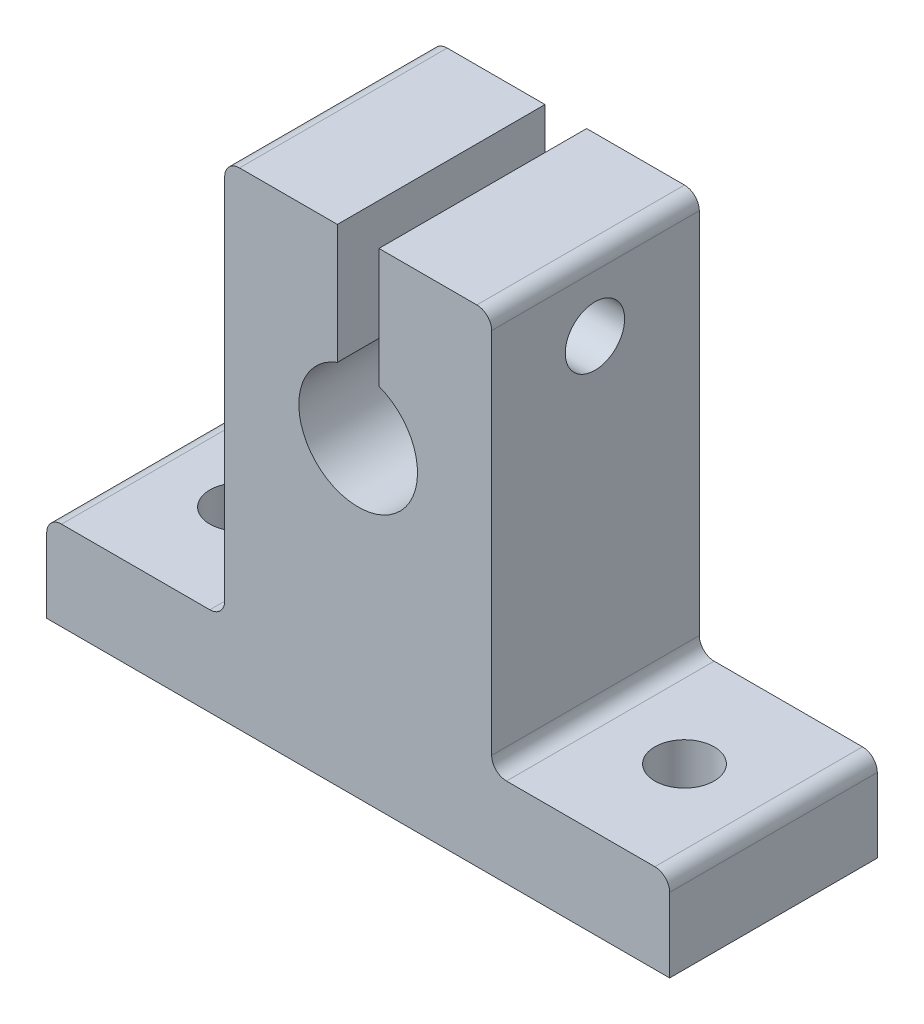
ISO-10303-21;
HEADER;
FILE_DESCRIPTION(('STEP AP214'),'2;1');
FILE_NAME('part.step','',(''),(''),'','','');
FILE_SCHEMA(('AUTOMOTIVE_DESIGN { 1 0 10303 214 1 1 1 1 }'));
ENDSEC;
DATA;
#1=APPLICATION_CONTEXT('core data for automotive mechanical design processes');
#2=APPLICATION_PROTOCOL_DEFINITION('international standard','automotive_design',2000,#1);
#3=PRODUCT_CONTEXT('',#1,'mechanical');
#4=PRODUCT('Part','Part','',(#3));
#5=PRODUCT_RELATED_PRODUCT_CATEGORY('part','',(#4));
#6=PRODUCT_DEFINITION_FORMATION('','',#4);
#7=PRODUCT_DEFINITION_CONTEXT('part definition',#1,'design');
#8=PRODUCT_DEFINITION('design','',#6,#7);
#9=PRODUCT_DEFINITION_SHAPE('','',#8);
#10=(LENGTH_UNIT() NAMED_UNIT(*) SI_UNIT(.MILLI.,.METRE.));
#11=(NAMED_UNIT(*) PLANE_ANGLE_UNIT() SI_UNIT($,.RADIAN.));
#12=(NAMED_UNIT(*) SI_UNIT($,.STERADIAN.) SOLID_ANGLE_UNIT());
#13=UNCERTAINTY_MEASURE_WITH_UNIT(LENGTH_MEASURE(1.E-05),#10,'distance_accuracy_value','');
#14=(GEOMETRIC_REPRESENTATION_CONTEXT(3) GLOBAL_UNCERTAINTY_ASSIGNED_CONTEXT((#13)) GLOBAL_UNIT_ASSIGNED_CONTEXT((#10,
#11,#12)) REPRESENTATION_CONTEXT('',''));
#15=CARTESIAN_POINT('',(0.,0.,0.));
#16=DIRECTION('',(0.,0.,1.));
#17=DIRECTION('',(1.,0.,0.));
#18=AXIS2_PLACEMENT_3D('',#15,#16,#17);
#19=CARTESIAN_POINT('',(-58.3706754806453,0.,14.));
#20=DIRECTION('',(1.,0.,0.));
#21=DIRECTION('',(0.,1.,0.));
#22=AXIS2_PLACEMENT_3D('',#19,#20,#21);
#23=PLANE('',#22);
#24=DIRECTION('',(0.,-1.,0.));
#25=VECTOR('',#24,1.);
#26=CARTESIAN_POINT('',(-58.3706754806453,0.,0.));
#27=LINE('',#26,#25);
#28=CARTESIAN_POINT('',(-58.3706754806453,4.99999999999999,0.));
#29=VERTEX_POINT('',#28);
#30=CARTESIAN_POINT('',(-58.3706754806453,0.,0.));
#31=VERTEX_POINT('',#30);
#32=EDGE_CURVE('E189',#29,#31,#27,.T.);
#33=ORIENTED_EDGE('',*,*,#32,.T.);
#34=DIRECTION('',(0.,0.,-1.));
#35=VECTOR('',#34,1.);
#36=CARTESIAN_POINT('',(-58.3706754806453,0.,14.));
#37=LINE('',#36,#35);
#38=CARTESIAN_POINT('',(-58.3706754806453,0.,14.));
#39=VERTEX_POINT('',#38);
#40=EDGE_CURVE('E11',#39,#31,#37,.T.);
#41=ORIENTED_EDGE('',*,*,#40,.F.);
#42=DIRECTION('',(0.,-1.,0.));
#43=VECTOR('',#42,1.);
#44=CARTESIAN_POINT('',(-58.3706754806453,0.,14.));
#45=LINE('',#44,#43);
#46=CARTESIAN_POINT('',(-58.3706754806453,4.99999999999999,14.));
#47=VERTEX_POINT('',#46);
#48=EDGE_CURVE('E224',#47,#39,#45,.T.);
#49=ORIENTED_EDGE('',*,*,#48,.F.);
#50=DIRECTION('',(0.,0.,-1.));
#51=VECTOR('',#50,1.);
#52=CARTESIAN_POINT('',(-58.3706754806453,4.99999999999999,14.));
#53=LINE('',#52,#51);
#54=EDGE_CURVE('E185',#47,#29,#53,.T.);
#55=ORIENTED_EDGE('',*,*,#54,.T.);
#56=EDGE_LOOP('',(#33,#41,#49,#55));
#57=FACE_BOUND('',#56,.T.);
#58=ADVANCED_FACE('F32',(#57),#23,.F.);
#59=CARTESIAN_POINT('',(-58.3706754806453,0.,14.));
#60=DIRECTION('',(0.,1.,0.));
#61=DIRECTION('',(0.,0.,1.));
#62=AXIS2_PLACEMENT_3D('',#59,#60,#61);
#63=PLANE('',#62);
#64=CARTESIAN_POINT('',(-52.3706754806453,0.,7.));
#65=DIRECTION('',(0.,1.,0.));
#66=DIRECTION('',(0.,0.,1.));
#67=AXIS2_PLACEMENT_3D('',#64,#65,#66);
#68=CIRCLE('',#67,2.);
#69=CARTESIAN_POINT('',(-52.3706754806453,0.,9.));
#70=VERTEX_POINT('',#69);
#71=EDGE_CURVE('E552',#70,#70,#68,.T.);
#72=ORIENTED_EDGE('',*,*,#71,.T.);
#73=EDGE_LOOP('',(#72));
#74=FACE_BOUND('',#73,.T.);
#75=CARTESIAN_POINT('',(-22.3706754806453,0.,7.));
#76=DIRECTION('',(0.,1.,0.));
#77=DIRECTION('',(0.,0.,1.));
#78=AXIS2_PLACEMENT_3D('',#75,#76,#77);
#79=CIRCLE('',#78,2.);
#80=CARTESIAN_POINT('',(-22.3706754806453,0.,9.));
#81=VERTEX_POINT('',#80);
#82=EDGE_CURVE('E193',#81,#81,#79,.T.);
#83=ORIENTED_EDGE('',*,*,#82,.T.);
#84=EDGE_LOOP('',(#83));
#85=FACE_BOUND('',#84,.T.);
#86=DIRECTION('',(1.,0.,0.));
#87=VECTOR('',#86,1.);
#88=CARTESIAN_POINT('',(-58.3706754806453,0.,0.));
#89=LINE('',#88,#87);
#90=CARTESIAN_POINT('',(-16.3706754806453,0.,0.));
#91=VERTEX_POINT('',#90);
#92=EDGE_CURVE('E192',#31,#91,#89,.T.);
#93=ORIENTED_EDGE('',*,*,#92,.T.);
#94=DIRECTION('',(0.,0.,-1.));
#95=VECTOR('',#94,1.);
#96=CARTESIAN_POINT('',(-16.3706754806453,0.,14.));
#97=LINE('',#96,#95);
#98=CARTESIAN_POINT('',(-16.3706754806453,0.,14.));
#99=VERTEX_POINT('',#98);
#100=EDGE_CURVE('E41',#99,#91,#97,.T.);
#101=ORIENTED_EDGE('',*,*,#100,.F.);
#102=DIRECTION('',(1.,0.,0.));
#103=VECTOR('',#102,1.);
#104=CARTESIAN_POINT('',(-58.3706754806453,0.,14.));
#105=LINE('',#104,#103);
#106=EDGE_CURVE('E122',#39,#99,#105,.T.);
#107=ORIENTED_EDGE('',*,*,#106,.F.);
#108=ORIENTED_EDGE('',*,*,#40,.T.);
#109=EDGE_LOOP('',(#93,#101,#107,#108));
#110=FACE_BOUND('',#109,.T.);
#111=ADVANCED_FACE('F334',(#74,#85,#110),#63,.F.);
#112=CARTESIAN_POINT('',(-16.3706754806453,0.,14.));
#113=DIRECTION('',(-1.,0.,0.));
#114=DIRECTION('',(0.,0.,1.));
#115=AXIS2_PLACEMENT_3D('',#112,#113,#114);
#116=PLANE('',#115);
#117=DIRECTION('',(0.,1.,0.));
#118=VECTOR('',#117,1.);
#119=CARTESIAN_POINT('',(-16.3706754806453,0.,0.));
#120=LINE('',#119,#118);
#121=CARTESIAN_POINT('',(-16.3706754806453,4.99999999999999,0.));
#122=VERTEX_POINT('',#121);
#123=EDGE_CURVE('E195',#91,#122,#120,.T.);
#124=ORIENTED_EDGE('',*,*,#123,.T.);
#125=DIRECTION('',(0.,0.,-1.));
#126=VECTOR('',#125,1.);
#127=CARTESIAN_POINT('',(-16.3706754806453,4.99999999999999,14.));
#128=LINE('',#127,#126);
#129=CARTESIAN_POINT('',(-16.3706754806453,4.99999999999999,14.));
#130=VERTEX_POINT('',#129);
#131=EDGE_CURVE('E261',#130,#122,#128,.T.);
#132=ORIENTED_EDGE('',*,*,#131,.F.);
#133=DIRECTION('',(0.,1.,0.));
#134=VECTOR('',#133,1.);
#135=CARTESIAN_POINT('',(-16.3706754806453,0.,14.));
#136=LINE('',#135,#134);
#137=EDGE_CURVE('E270',#99,#130,#136,.T.);
#138=ORIENTED_EDGE('',*,*,#137,.F.);
#139=ORIENTED_EDGE('',*,*,#100,.T.);
#140=EDGE_LOOP('',(#124,#132,#138,#139));
#141=FACE_BOUND('',#140,.T.);
#142=ADVANCED_FACE('F268',(#141),#116,.F.);
#143=CARTESIAN_POINT('',(-17.3706754806453,5.,14.));
#144=DIRECTION('',(0.,0.,-1.));
#145=DIRECTION('',(-1.,0.,0.));
#146=AXIS2_PLACEMENT_3D('',#143,#144,#145);
#147=CYLINDRICAL_SURFACE('',#146,1.);
#148=CARTESIAN_POINT('',(-17.3706754806453,5.,0.));
#149=DIRECTION('',(0.,0.,1.));
#150=DIRECTION('',(1.,0.,0.));
#151=AXIS2_PLACEMENT_3D('',#148,#149,#150);
#152=CIRCLE('',#151,1.);
#153=CARTESIAN_POINT('',(-17.3706754806453,6.,0.));
#154=VERTEX_POINT('',#153);
#155=EDGE_CURVE('E197',#122,#154,#152,.T.);
#156=ORIENTED_EDGE('',*,*,#155,.T.);
#157=DIRECTION('',(0.,0.,-1.));
#158=VECTOR('',#157,1.);
#159=CARTESIAN_POINT('',(-17.3706754806453,6.,14.));
#160=LINE('',#159,#158);
#161=CARTESIAN_POINT('',(-17.3706754806453,6.,14.));
#162=VERTEX_POINT('',#161);
#163=EDGE_CURVE('E258',#162,#154,#160,.T.);
#164=ORIENTED_EDGE('',*,*,#163,.F.);
#165=CARTESIAN_POINT('',(-17.3706754806453,5.,14.));
#166=DIRECTION('',(0.,0.,1.));
#167=DIRECTION('',(1.,0.,0.));
#168=AXIS2_PLACEMENT_3D('',#165,#166,#167);
#169=CIRCLE('',#168,1.);
#170=EDGE_CURVE('E288',#130,#162,#169,.T.);
#171=ORIENTED_EDGE('',*,*,#170,.F.);
#172=ORIENTED_EDGE('',*,*,#131,.T.);
#173=EDGE_LOOP('',(#156,#164,#171,#172));
#174=FACE_BOUND('',#173,.T.);
#175=ADVANCED_FACE('F279',(#174),#147,.T.);
#176=CARTESIAN_POINT('',(-17.3706754806453,6.,14.));
#177=DIRECTION('',(0.,-1.,0.));
#178=DIRECTION('',(1.,0.,0.));
#179=AXIS2_PLACEMENT_3D('',#176,#177,#178);
#180=PLANE('',#179);
#181=CARTESIAN_POINT('',(-22.3706754806453,6.,7.));
#182=DIRECTION('',(0.,1.,0.));
#183=DIRECTION('',(-1.,0.,0.));
#184=AXIS2_PLACEMENT_3D('',#181,#182,#183);
#185=CIRCLE('',#184,2.);
#186=CARTESIAN_POINT('',(-24.3706754806453,6.,7.));
#187=VERTEX_POINT('',#186);
#188=EDGE_CURVE('E559',#187,#187,#185,.T.);
#189=ORIENTED_EDGE('',*,*,#188,.F.);
#190=EDGE_LOOP('',(#189));
#191=FACE_BOUND('',#190,.T.);
#192=DIRECTION('',(-1.,0.,0.));
#193=VECTOR('',#192,1.);
#194=CARTESIAN_POINT('',(-17.3706754806453,6.,0.));
#195=LINE('',#194,#193);
#196=CARTESIAN_POINT('',(-27.3706754806453,6.,0.));
#197=VERTEX_POINT('',#196);
#198=EDGE_CURVE('E199',#154,#197,#195,.T.);
#199=ORIENTED_EDGE('',*,*,#198,.T.);
#200=DIRECTION('',(0.,0.,-1.));
#201=VECTOR('',#200,1.);
#202=CARTESIAN_POINT('',(-27.3706754806453,6.,14.));
#203=LINE('',#202,#201);
#204=CARTESIAN_POINT('',(-27.3706754806453,6.,14.));
#205=VERTEX_POINT('',#204);
#206=EDGE_CURVE('E255',#205,#197,#203,.T.);
#207=ORIENTED_EDGE('',*,*,#206,.F.);
#208=DIRECTION('',(-1.,0.,0.));
#209=VECTOR('',#208,1.);
#210=CARTESIAN_POINT('',(-17.3706754806453,6.,14.));
#211=LINE('',#210,#209);
#212=EDGE_CURVE('E285',#162,#205,#211,.T.);
#213=ORIENTED_EDGE('',*,*,#212,.F.);
#214=ORIENTED_EDGE('',*,*,#163,.T.);
#215=EDGE_LOOP('',(#199,#207,#213,#214));
#216=FACE_BOUND('',#215,.T.);
#217=ADVANCED_FACE('F283',(#191,#216),#180,.F.);
#218=CARTESIAN_POINT('',(-27.3706754806453,7.,14.));
#219=DIRECTION('',(0.,0.,-1.));
#220=DIRECTION('',(-1.,0.,0.));
#221=AXIS2_PLACEMENT_3D('',#218,#219,#220);
#222=CYLINDRICAL_SURFACE('',#221,1.);
#223=CARTESIAN_POINT('',(-27.3706754806453,7.,0.));
#224=DIRECTION('',(0.,0.,-1.));
#225=DIRECTION('',(1.,0.,0.));
#226=AXIS2_PLACEMENT_3D('',#223,#224,#225);
#227=CIRCLE('',#226,1.);
#228=CARTESIAN_POINT('',(-28.3706754806453,7.00000000000001,0.));
#229=VERTEX_POINT('',#228);
#230=EDGE_CURVE('E201',#197,#229,#227,.T.);
#231=ORIENTED_EDGE('',*,*,#230,.T.);
#232=DIRECTION('',(0.,0.,-1.));
#233=VECTOR('',#232,1.);
#234=CARTESIAN_POINT('',(-28.3706754806453,7.00000000000001,14.));
#235=LINE('',#234,#233);
#236=CARTESIAN_POINT('',(-28.3706754806453,7.00000000000001,14.));
#237=VERTEX_POINT('',#236);
#238=EDGE_CURVE('E252',#237,#229,#235,.T.);
#239=ORIENTED_EDGE('',*,*,#238,.F.);
#240=CARTESIAN_POINT('',(-27.3706754806453,7.,14.));
#241=DIRECTION('',(0.,0.,-1.));
#242=DIRECTION('',(1.,0.,0.));
#243=AXIS2_PLACEMENT_3D('',#240,#241,#242);
#244=CIRCLE('',#243,1.);
#245=EDGE_CURVE('E287',#205,#237,#244,.T.);
#246=ORIENTED_EDGE('',*,*,#245,.F.);
#247=ORIENTED_EDGE('',*,*,#206,.T.);
#248=EDGE_LOOP('',(#231,#239,#246,#247));
#249=FACE_BOUND('',#248,.T.);
#250=ADVANCED_FACE('F350',(#249),#222,.F.);
#251=CARTESIAN_POINT('',(-28.3706754806453,7.00000000000001,14.));
#252=DIRECTION('',(-1.,0.,0.));
#253=DIRECTION('',(0.,0.,1.));
#254=AXIS2_PLACEMENT_3D('',#251,#252,#253);
#255=PLANE('',#254);
#256=CARTESIAN_POINT('',(-28.3706754806453,28.,7.03749154393044));
#257=DIRECTION('',(1.,0.,0.));
#258=DIRECTION('',(0.,0.,-1.));
#259=AXIS2_PLACEMENT_3D('',#256,#257,#258);
#260=CIRCLE('',#259,2.);
#261=CARTESIAN_POINT('',(-28.3706754806453,28.,5.03749154393043));
#262=VERTEX_POINT('',#261);
#263=EDGE_CURVE('E544',#262,#262,#260,.T.);
#264=ORIENTED_EDGE('',*,*,#263,.F.);
#265=EDGE_LOOP('',(#264));
#266=FACE_BOUND('',#265,.T.);
#267=DIRECTION('',(0.,1.,0.));
#268=VECTOR('',#267,1.);
#269=CARTESIAN_POINT('',(-28.3706754806453,7.00000000000001,0.));
#270=LINE('',#269,#268);
#271=CARTESIAN_POINT('',(-28.3706754806453,31.8,0.));
#272=VERTEX_POINT('',#271);
#273=EDGE_CURVE('E203',#229,#272,#270,.T.);
#274=ORIENTED_EDGE('',*,*,#273,.T.);
#275=DIRECTION('',(0.,0.,-1.));
#276=VECTOR('',#275,1.);
#277=CARTESIAN_POINT('',(-28.3706754806453,31.8,14.));
#278=LINE('',#277,#276);
#279=CARTESIAN_POINT('',(-28.3706754806453,31.8,14.));
#280=VERTEX_POINT('',#279);
#281=EDGE_CURVE('E249',#280,#272,#278,.T.);
#282=ORIENTED_EDGE('',*,*,#281,.F.);
#283=DIRECTION('',(0.,1.,0.));
#284=VECTOR('',#283,1.);
#285=CARTESIAN_POINT('',(-28.3706754806453,7.00000000000001,14.));
#286=LINE('',#285,#284);
#287=EDGE_CURVE('E290',#237,#280,#286,.T.);
#288=ORIENTED_EDGE('',*,*,#287,.F.);
#289=ORIENTED_EDGE('',*,*,#238,.T.);
#290=EDGE_LOOP('',(#274,#282,#288,#289));
#291=FACE_BOUND('',#290,.T.);
#292=ADVANCED_FACE('F354',(#266,#291),#255,.F.);
#293=CARTESIAN_POINT('',(-29.3706754806453,31.8,14.));
#294=DIRECTION('',(0.,0.,-1.));
#295=DIRECTION('',(-1.,0.,0.));
#296=AXIS2_PLACEMENT_3D('',#293,#294,#295);
#297=CYLINDRICAL_SURFACE('',#296,1.);
#298=CARTESIAN_POINT('',(-29.3706754806453,31.8,0.));
#299=DIRECTION('',(0.,0.,1.));
#300=DIRECTION('',(1.,0.,0.));
#301=AXIS2_PLACEMENT_3D('',#298,#299,#300);
#302=CIRCLE('',#301,1.);
#303=CARTESIAN_POINT('',(-29.3706754806453,32.8,0.));
#304=VERTEX_POINT('',#303);
#305=EDGE_CURVE('E205',#272,#304,#302,.T.);
#306=ORIENTED_EDGE('',*,*,#305,.T.);
#307=DIRECTION('',(0.,0.,-1.));
#308=VECTOR('',#307,1.);
#309=CARTESIAN_POINT('',(-29.3706754806453,32.8,14.));
#310=LINE('',#309,#308);
#311=CARTESIAN_POINT('',(-29.3706754806453,32.8,14.));
#312=VERTEX_POINT('',#311);
#313=EDGE_CURVE('E246',#312,#304,#310,.T.);
#314=ORIENTED_EDGE('',*,*,#313,.F.);
#315=CARTESIAN_POINT('',(-29.3706754806453,31.8,14.));
#316=DIRECTION('',(0.,0.,1.));
#317=DIRECTION('',(1.,0.,0.));
#318=AXIS2_PLACEMENT_3D('',#315,#316,#317);
#319=CIRCLE('',#318,1.);
#320=EDGE_CURVE('E296',#280,#312,#319,.T.);
#321=ORIENTED_EDGE('',*,*,#320,.F.);
#322=ORIENTED_EDGE('',*,*,#281,.T.);
#323=EDGE_LOOP('',(#306,#314,#321,#322));
#324=FACE_BOUND('',#323,.T.);
#325=ADVANCED_FACE('F358',(#324),#297,.T.);
#326=CARTESIAN_POINT('',(-29.3706754806453,32.8,14.));
#327=DIRECTION('',(0.,-1.,0.));
#328=DIRECTION('',(0.,0.,-1.));
#329=AXIS2_PLACEMENT_3D('',#326,#327,#328);
#330=PLANE('',#329);
#331=DIRECTION('',(-1.,0.,0.));
#332=VECTOR('',#331,1.);
#333=CARTESIAN_POINT('',(-29.3706754806453,32.8,0.));
#334=LINE('',#333,#332);
#335=CARTESIAN_POINT('',(-35.968113831463,32.8,0.));
#336=VERTEX_POINT('',#335);
#337=EDGE_CURVE('E207',#304,#336,#334,.T.);
#338=ORIENTED_EDGE('',*,*,#337,.T.);
#339=DIRECTION('',(0.,0.,-1.));
#340=VECTOR('',#339,1.);
#341=CARTESIAN_POINT('',(-35.968113831463,32.8,14.));
#342=LINE('',#341,#340);
#343=CARTESIAN_POINT('',(-35.968113831463,32.8,14.));
#344=VERTEX_POINT('',#343);
#345=EDGE_CURVE('E243',#344,#336,#342,.T.);
#346=ORIENTED_EDGE('',*,*,#345,.F.);
#347=DIRECTION('',(-1.,0.,0.));
#348=VECTOR('',#347,1.);
#349=CARTESIAN_POINT('',(-29.3706754806453,32.8,14.));
#350=LINE('',#349,#348);
#351=EDGE_CURVE('E298',#312,#344,#350,.T.);
#352=ORIENTED_EDGE('',*,*,#351,.F.);
#353=ORIENTED_EDGE('',*,*,#313,.T.);
#354=EDGE_LOOP('',(#338,#346,#352,#353));
#355=FACE_BOUND('',#354,.T.);
#356=ADVANCED_FACE('F362',(#355),#330,.F.);
#357=CARTESIAN_POINT('',(-35.968113831463,32.8,14.));
#358=DIRECTION('',(1.,0.,0.));
#359=DIRECTION('',(0.,0.,-1.));
#360=AXIS2_PLACEMENT_3D('',#357,#358,#359);
#361=PLANE('',#360);
#362=CARTESIAN_POINT('',(-35.968113831463,28.,7.03749154393044));
#363=DIRECTION('',(1.,0.,0.));
#364=DIRECTION('',(0.,0.,-1.));
#365=AXIS2_PLACEMENT_3D('',#362,#363,#364);
#366=CIRCLE('',#365,2.);
#367=CARTESIAN_POINT('',(-35.968113831463,28.,5.03749154393043));
#368=VERTEX_POINT('',#367);
#369=EDGE_CURVE('E547',#368,#368,#366,.T.);
#370=ORIENTED_EDGE('',*,*,#369,.T.);
#371=EDGE_LOOP('',(#370));
#372=FACE_BOUND('',#371,.T.);
#373=DIRECTION('',(0.,-1.,0.));
#374=VECTOR('',#373,1.);
#375=CARTESIAN_POINT('',(-35.968113831463,32.8,0.));
#376=LINE('',#375,#374);
#377=CARTESIAN_POINT('',(-35.968113831463,24.7460406858766,0.));
#378=VERTEX_POINT('',#377);
#379=EDGE_CURVE('E209',#336,#378,#376,.T.);
#380=ORIENTED_EDGE('',*,*,#379,.T.);
#381=DIRECTION('',(0.,0.,-1.));
#382=VECTOR('',#381,1.);
#383=CARTESIAN_POINT('',(-35.968113831463,24.7460406858766,14.));
#384=LINE('',#383,#382);
#385=CARTESIAN_POINT('',(-35.968113831463,24.7460406858766,14.));
#386=VERTEX_POINT('',#385);
#387=EDGE_CURVE('E240',#386,#378,#384,.T.);
#388=ORIENTED_EDGE('',*,*,#387,.F.);
#389=DIRECTION('',(0.,-1.,0.));
#390=VECTOR('',#389,1.);
#391=CARTESIAN_POINT('',(-35.968113831463,32.8,14.));
#392=LINE('',#391,#390);
#393=EDGE_CURVE('E300',#344,#386,#392,.T.);
#394=ORIENTED_EDGE('',*,*,#393,.F.);
#395=ORIENTED_EDGE('',*,*,#345,.T.);
#396=EDGE_LOOP('',(#380,#388,#394,#395));
#397=FACE_BOUND('',#396,.T.);
#398=ADVANCED_FACE('F366',(#372,#397),#361,.F.);
#399=CARTESIAN_POINT('',(-37.3706754806453,21.,14.));
#400=DIRECTION('',(0.,0.,-1.));
#401=DIRECTION('',(-1.,0.,0.));
#402=AXIS2_PLACEMENT_3D('',#399,#400,#401);
#403=CYLINDRICAL_SURFACE('',#402,4.00000000000001);
#404=CARTESIAN_POINT('',(-37.3706754806453,21.,0.));
#405=DIRECTION('',(0.,0.,-1.));
#406=DIRECTION('',(1.,0.,0.));
#407=AXIS2_PLACEMENT_3D('',#404,#405,#406);
#408=CIRCLE('',#407,4.00000000000001);
#409=CARTESIAN_POINT('',(-38.7732371298276,24.7460406858767,0.));
#410=VERTEX_POINT('',#409);
#411=EDGE_CURVE('E211',#378,#410,#408,.T.);
#412=ORIENTED_EDGE('',*,*,#411,.T.);
#413=DIRECTION('',(0.,0.,-1.));
#414=VECTOR('',#413,1.);
#415=CARTESIAN_POINT('',(-38.7732371298276,24.7460406858767,14.));
#416=LINE('',#415,#414);
#417=CARTESIAN_POINT('',(-38.7732371298276,24.7460406858767,14.));
#418=VERTEX_POINT('',#417);
#419=EDGE_CURVE('E237',#418,#410,#416,.T.);
#420=ORIENTED_EDGE('',*,*,#419,.F.);
#421=CARTESIAN_POINT('',(-37.3706754806453,21.,14.));
#422=DIRECTION('',(0.,0.,-1.));
#423=DIRECTION('',(1.,0.,0.));
#424=AXIS2_PLACEMENT_3D('',#421,#422,#423);
#425=CIRCLE('',#424,4.00000000000001);
#426=EDGE_CURVE('E302',#386,#418,#425,.T.);
#427=ORIENTED_EDGE('',*,*,#426,.F.);
#428=ORIENTED_EDGE('',*,*,#387,.T.);
#429=EDGE_LOOP('',(#412,#420,#427,#428));
#430=FACE_BOUND('',#429,.T.);
#431=ADVANCED_FACE('F370',(#430),#403,.F.);
#432=CARTESIAN_POINT('',(-38.7732371298276,32.8,14.));
#433=DIRECTION('',(-1.,0.,0.));
#434=DIRECTION('',(0.,0.,1.));
#435=AXIS2_PLACEMENT_3D('',#432,#433,#434);
#436=PLANE('',#435);
#437=CARTESIAN_POINT('',(-38.7732371298276,28.,7.03749154393044));
#438=DIRECTION('',(-1.,0.,0.));
#439=DIRECTION('',(0.,0.,1.));
#440=AXIS2_PLACEMENT_3D('',#437,#438,#439);
#441=CIRCLE('',#440,2.);
#442=CARTESIAN_POINT('',(-38.7732371298276,28.,9.03749154393044));
#443=VERTEX_POINT('',#442);
#444=EDGE_CURVE('E549',#443,#443,#441,.T.);
#445=ORIENTED_EDGE('',*,*,#444,.T.);
#446=EDGE_LOOP('',(#445));
#447=FACE_BOUND('',#446,.T.);
#448=DIRECTION('',(0.,1.,0.));
#449=VECTOR('',#448,1.);
#450=CARTESIAN_POINT('',(-38.7732371298276,32.8,0.));
#451=LINE('',#450,#449);
#452=CARTESIAN_POINT('',(-38.7732371298276,32.8,0.));
#453=VERTEX_POINT('',#452);
#454=EDGE_CURVE('E213',#410,#453,#451,.T.);
#455=ORIENTED_EDGE('',*,*,#454,.T.);
#456=DIRECTION('',(0.,0.,-1.));
#457=VECTOR('',#456,1.);
#458=CARTESIAN_POINT('',(-38.7732371298276,32.8,14.));
#459=LINE('',#458,#457);
#460=CARTESIAN_POINT('',(-38.7732371298276,32.8,14.));
#461=VERTEX_POINT('',#460);
#462=EDGE_CURVE('E234',#461,#453,#459,.T.);
#463=ORIENTED_EDGE('',*,*,#462,.F.);
#464=DIRECTION('',(0.,1.,0.));
#465=VECTOR('',#464,1.);
#466=CARTESIAN_POINT('',(-38.7732371298276,32.8,14.));
#467=LINE('',#466,#465);
#468=EDGE_CURVE('E304',#418,#461,#467,.T.);
#469=ORIENTED_EDGE('',*,*,#468,.F.);
#470=ORIENTED_EDGE('',*,*,#419,.T.);
#471=EDGE_LOOP('',(#455,#463,#469,#470));
#472=FACE_BOUND('',#471,.T.);
#473=ADVANCED_FACE('F374',(#447,#472),#436,.F.);
#474=CARTESIAN_POINT('',(-45.3706754806453,32.8,14.));
#475=DIRECTION('',(0.,-1.,0.));
#476=DIRECTION('',(0.,0.,-1.));
#477=AXIS2_PLACEMENT_3D('',#474,#475,#476);
#478=PLANE('',#477);
#479=DIRECTION('',(-1.,0.,0.));
#480=VECTOR('',#479,1.);
#481=CARTESIAN_POINT('',(-45.3706754806453,32.8,0.));
#482=LINE('',#481,#480);
#483=CARTESIAN_POINT('',(-45.3706754806453,32.8,0.));
#484=VERTEX_POINT('',#483);
#485=EDGE_CURVE('E215',#453,#484,#482,.T.);
#486=ORIENTED_EDGE('',*,*,#485,.T.);
#487=DIRECTION('',(0.,0.,-1.));
#488=VECTOR('',#487,1.);
#489=CARTESIAN_POINT('',(-45.3706754806453,32.8,14.));
#490=LINE('',#489,#488);
#491=CARTESIAN_POINT('',(-45.3706754806453,32.8,14.));
#492=VERTEX_POINT('',#491);
#493=EDGE_CURVE('E231',#492,#484,#490,.T.);
#494=ORIENTED_EDGE('',*,*,#493,.F.);
#495=DIRECTION('',(-1.,0.,0.));
#496=VECTOR('',#495,1.);
#497=CARTESIAN_POINT('',(-45.3706754806453,32.8,14.));
#498=LINE('',#497,#496);
#499=EDGE_CURVE('E306',#461,#492,#498,.T.);
#500=ORIENTED_EDGE('',*,*,#499,.F.);
#501=ORIENTED_EDGE('',*,*,#462,.T.);
#502=EDGE_LOOP('',(#486,#494,#500,#501));
#503=FACE_BOUND('',#502,.T.);
#504=ADVANCED_FACE('F378',(#503),#478,.F.);
#505=CARTESIAN_POINT('',(-45.3706754806453,31.8,14.));
#506=DIRECTION('',(0.,0.,-1.));
#507=DIRECTION('',(-1.,0.,0.));
#508=AXIS2_PLACEMENT_3D('',#505,#506,#507);
#509=CYLINDRICAL_SURFACE('',#508,1.);
#510=CARTESIAN_POINT('',(-45.3706754806453,31.8,0.));
#511=DIRECTION('',(0.,0.,1.));
#512=DIRECTION('',(-1.,0.,0.));
#513=AXIS2_PLACEMENT_3D('',#510,#511,#512);
#514=CIRCLE('',#513,1.);
#515=CARTESIAN_POINT('',(-46.3706754806453,31.8,0.));
#516=VERTEX_POINT('',#515);
#517=EDGE_CURVE('E217',#484,#516,#514,.T.);
#518=ORIENTED_EDGE('',*,*,#517,.T.);
#519=DIRECTION('',(0.,0.,-1.));
#520=VECTOR('',#519,1.);
#521=CARTESIAN_POINT('',(-46.3706754806453,31.8,14.));
#522=LINE('',#521,#520);
#523=CARTESIAN_POINT('',(-46.3706754806453,31.8,14.));
#524=VERTEX_POINT('',#523);
#525=EDGE_CURVE('E228',#524,#516,#522,.T.);
#526=ORIENTED_EDGE('',*,*,#525,.F.);
#527=CARTESIAN_POINT('',(-45.3706754806453,31.8,14.));
#528=DIRECTION('',(0.,0.,1.));
#529=DIRECTION('',(-1.,0.,0.));
#530=AXIS2_PLACEMENT_3D('',#527,#528,#529);
#531=CIRCLE('',#530,1.);
#532=EDGE_CURVE('E308',#492,#524,#531,.T.);
#533=ORIENTED_EDGE('',*,*,#532,.F.);
#534=ORIENTED_EDGE('',*,*,#493,.T.);
#535=EDGE_LOOP('',(#518,#526,#533,#534));
#536=FACE_BOUND('',#535,.T.);
#537=ADVANCED_FACE('F314',(#536),#509,.T.);
#538=CARTESIAN_POINT('',(-46.3706754806453,7.00000000000001,14.));
#539=DIRECTION('',(1.,0.,0.));
#540=DIRECTION('',(0.,0.,-1.));
#541=AXIS2_PLACEMENT_3D('',#538,#539,#540);
#542=PLANE('',#541);
#543=CARTESIAN_POINT('',(-46.3706754806453,28.,7.03749154393044));
#544=DIRECTION('',(1.,0.,0.));
#545=DIRECTION('',(0.,0.,-1.));
#546=AXIS2_PLACEMENT_3D('',#543,#544,#545);
#547=CIRCLE('',#546,2.);
#548=CARTESIAN_POINT('',(-46.3706754806453,28.,5.03749154393043));
#549=VERTEX_POINT('',#548);
#550=EDGE_CURVE('E35',#549,#549,#547,.T.);
#551=ORIENTED_EDGE('',*,*,#550,.T.);
#552=EDGE_LOOP('',(#551));
#553=FACE_BOUND('',#552,.T.);
#554=DIRECTION('',(0.,-1.,0.));
#555=VECTOR('',#554,1.);
#556=CARTESIAN_POINT('',(-46.3706754806453,7.00000000000001,0.));
#557=LINE('',#556,#555);
#558=CARTESIAN_POINT('',(-46.3706754806453,7.00000000000001,0.));
#559=VERTEX_POINT('',#558);
#560=EDGE_CURVE('E219',#516,#559,#557,.T.);
#561=ORIENTED_EDGE('',*,*,#560,.T.);
#562=DIRECTION('',(0.,0.,-1.));
#563=VECTOR('',#562,1.);
#564=CARTESIAN_POINT('',(-46.3706754806453,7.00000000000001,14.));
#565=LINE('',#564,#563);
#566=CARTESIAN_POINT('',(-46.3706754806453,7.00000000000001,14.));
#567=VERTEX_POINT('',#566);
#568=EDGE_CURVE('E180',#567,#559,#565,.T.);
#569=ORIENTED_EDGE('',*,*,#568,.F.);
#570=DIRECTION('',(0.,-1.,0.));
#571=VECTOR('',#570,1.);
#572=CARTESIAN_POINT('',(-46.3706754806453,7.00000000000001,14.));
#573=LINE('',#572,#571);
#574=EDGE_CURVE('E171',#524,#567,#573,.T.);
#575=ORIENTED_EDGE('',*,*,#574,.F.);
#576=ORIENTED_EDGE('',*,*,#525,.T.);
#577=EDGE_LOOP('',(#561,#569,#575,#576));
#578=FACE_BOUND('',#577,.T.);
#579=ADVANCED_FACE('F318',(#553,#578),#542,.F.);
#580=CARTESIAN_POINT('',(-47.3706754806453,7.,14.));
#581=DIRECTION('',(0.,0.,-1.));
#582=DIRECTION('',(-1.,0.,0.));
#583=AXIS2_PLACEMENT_3D('',#580,#581,#582);
#584=CYLINDRICAL_SURFACE('',#583,1.);
#585=CARTESIAN_POINT('',(-47.3706754806453,7.,0.));
#586=DIRECTION('',(0.,0.,-1.));
#587=DIRECTION('',(1.,0.,0.));
#588=AXIS2_PLACEMENT_3D('',#585,#586,#587);
#589=CIRCLE('',#588,1.);
#590=CARTESIAN_POINT('',(-47.3706754806453,6.,0.));
#591=VERTEX_POINT('',#590);
#592=EDGE_CURVE('E179',#559,#591,#589,.T.);
#593=ORIENTED_EDGE('',*,*,#592,.T.);
#594=DIRECTION('',(0.,0.,-1.));
#595=VECTOR('',#594,1.);
#596=CARTESIAN_POINT('',(-47.3706754806453,6.,14.));
#597=LINE('',#596,#595);
#598=CARTESIAN_POINT('',(-47.3706754806453,6.,14.));
#599=VERTEX_POINT('',#598);
#600=EDGE_CURVE('E176',#599,#591,#597,.T.);
#601=ORIENTED_EDGE('',*,*,#600,.F.);
#602=CARTESIAN_POINT('',(-47.3706754806453,7.,14.));
#603=DIRECTION('',(0.,0.,-1.));
#604=DIRECTION('',(1.,0.,0.));
#605=AXIS2_PLACEMENT_3D('',#602,#603,#604);
#606=CIRCLE('',#605,1.);
#607=EDGE_CURVE('E165',#567,#599,#606,.T.);
#608=ORIENTED_EDGE('',*,*,#607,.F.);
#609=ORIENTED_EDGE('',*,*,#568,.T.);
#610=EDGE_LOOP('',(#593,#601,#608,#609));
#611=FACE_BOUND('',#610,.T.);
#612=ADVANCED_FACE('F177',(#611),#584,.F.);
#613=CARTESIAN_POINT('',(-57.3706754806453,6.,14.));
#614=DIRECTION('',(0.,-1.,0.));
#615=DIRECTION('',(1.,0.,0.));
#616=AXIS2_PLACEMENT_3D('',#613,#614,#615);
#617=PLANE('',#616);
#618=CARTESIAN_POINT('',(-52.3706754806453,5.99999999999999,7.));
#619=DIRECTION('',(0.,1.,0.));
#620=DIRECTION('',(1.,0.,0.));
#621=AXIS2_PLACEMENT_3D('',#618,#619,#620);
#622=CIRCLE('',#621,2.);
#623=CARTESIAN_POINT('',(-50.3706754806453,5.99999999999999,7.));
#624=VERTEX_POINT('',#623);
#625=EDGE_CURVE('E548',#624,#624,#622,.T.);
#626=ORIENTED_EDGE('',*,*,#625,.F.);
#627=EDGE_LOOP('',(#626));
#628=FACE_BOUND('',#627,.T.);
#629=DIRECTION('',(-1.,0.,0.));
#630=VECTOR('',#629,1.);
#631=CARTESIAN_POINT('',(-57.3706754806453,6.,0.));
#632=LINE('',#631,#630);
#633=CARTESIAN_POINT('',(-57.3706754806453,6.,0.));
#634=VERTEX_POINT('',#633);
#635=EDGE_CURVE('E108',#591,#634,#632,.T.);
#636=ORIENTED_EDGE('',*,*,#635,.T.);
#637=DIRECTION('',(0.,0.,-1.));
#638=VECTOR('',#637,1.);
#639=CARTESIAN_POINT('',(-57.3706754806453,6.,14.));
#640=LINE('',#639,#638);
#641=CARTESIAN_POINT('',(-57.3706754806453,6.,14.));
#642=VERTEX_POINT('',#641);
#643=EDGE_CURVE('E181',#642,#634,#640,.T.);
#644=ORIENTED_EDGE('',*,*,#643,.F.);
#645=DIRECTION('',(-1.,0.,0.));
#646=VECTOR('',#645,1.);
#647=CARTESIAN_POINT('',(-57.3706754806453,6.,14.));
#648=LINE('',#647,#646);
#649=EDGE_CURVE('E169',#599,#642,#648,.T.);
#650=ORIENTED_EDGE('',*,*,#649,.F.);
#651=ORIENTED_EDGE('',*,*,#600,.T.);
#652=EDGE_LOOP('',(#636,#644,#650,#651));
#653=FACE_BOUND('',#652,.T.);
#654=ADVANCED_FACE('F183',(#628,#653),#617,.F.);
#655=CARTESIAN_POINT('',(-57.3706754806453,5.,14.));
#656=DIRECTION('',(0.,0.,-1.));
#657=DIRECTION('',(-1.,0.,0.));
#658=AXIS2_PLACEMENT_3D('',#655,#656,#657);
#659=CYLINDRICAL_SURFACE('',#658,1.);
#660=CARTESIAN_POINT('',(-57.3706754806453,5.,0.));
#661=DIRECTION('',(0.,0.,1.));
#662=DIRECTION('',(-1.,0.,0.));
#663=AXIS2_PLACEMENT_3D('',#660,#661,#662);
#664=CIRCLE('',#663,1.);
#665=EDGE_CURVE('E114',#634,#29,#664,.T.);
#666=ORIENTED_EDGE('',*,*,#665,.T.);
#667=ORIENTED_EDGE('',*,*,#54,.F.);
#668=CARTESIAN_POINT('',(-57.3706754806453,5.,14.));
#669=DIRECTION('',(0.,0.,1.));
#670=DIRECTION('',(-1.,0.,0.));
#671=AXIS2_PLACEMENT_3D('',#668,#669,#670);
#672=CIRCLE('',#671,1.);
#673=EDGE_CURVE('E49',#642,#47,#672,.T.);
#674=ORIENTED_EDGE('',*,*,#673,.F.);
#675=ORIENTED_EDGE('',*,*,#643,.T.);
#676=EDGE_LOOP('',(#666,#667,#674,#675));
#677=FACE_BOUND('',#676,.T.);
#678=ADVANCED_FACE('F322',(#677),#659,.T.);
#679=CARTESIAN_POINT('',(-57.3706754806453,5.,14.));
#680=DIRECTION('',(0.,0.,-1.));
#681=DIRECTION('',(-1.,0.,0.));
#682=AXIS2_PLACEMENT_3D('',#679,#680,#681);
#683=PLANE('',#682);
#684=ORIENTED_EDGE('',*,*,#48,.T.);
#685=ORIENTED_EDGE('',*,*,#106,.T.);
#686=ORIENTED_EDGE('',*,*,#137,.T.);
#687=ORIENTED_EDGE('',*,*,#170,.T.);
#688=ORIENTED_EDGE('',*,*,#212,.T.);
#689=ORIENTED_EDGE('',*,*,#245,.T.);
#690=ORIENTED_EDGE('',*,*,#287,.T.);
#691=ORIENTED_EDGE('',*,*,#320,.T.);
#692=ORIENTED_EDGE('',*,*,#351,.T.);
#693=ORIENTED_EDGE('',*,*,#393,.T.);
#694=ORIENTED_EDGE('',*,*,#426,.T.);
#695=ORIENTED_EDGE('',*,*,#468,.T.);
#696=ORIENTED_EDGE('',*,*,#499,.T.);
#697=ORIENTED_EDGE('',*,*,#532,.T.);
#698=ORIENTED_EDGE('',*,*,#574,.T.);
#699=ORIENTED_EDGE('',*,*,#607,.T.);
#700=ORIENTED_EDGE('',*,*,#649,.T.);
#701=ORIENTED_EDGE('',*,*,#673,.T.);
#702=EDGE_LOOP('',(#684,#685,#686,#687,#688,#689,#690,#691,#692,#693,#694,#695,#696,#697,#698,
#699,#700,#701));
#703=FACE_BOUND('',#702,.T.);
#704=ADVANCED_FACE('F167',(#703),#683,.F.);
#705=CARTESIAN_POINT('',(-57.3706754806453,5.,0.));
#706=DIRECTION('',(0.,0.,-1.));
#707=DIRECTION('',(-1.,0.,0.));
#708=AXIS2_PLACEMENT_3D('',#705,#706,#707);
#709=PLANE('',#708);
#710=ORIENTED_EDGE('',*,*,#32,.F.);
#711=ORIENTED_EDGE('',*,*,#665,.F.);
#712=ORIENTED_EDGE('',*,*,#635,.F.);
#713=ORIENTED_EDGE('',*,*,#592,.F.);
#714=ORIENTED_EDGE('',*,*,#560,.F.);
#715=ORIENTED_EDGE('',*,*,#517,.F.);
#716=ORIENTED_EDGE('',*,*,#485,.F.);
#717=ORIENTED_EDGE('',*,*,#454,.F.);
#718=ORIENTED_EDGE('',*,*,#411,.F.);
#719=ORIENTED_EDGE('',*,*,#379,.F.);
#720=ORIENTED_EDGE('',*,*,#337,.F.);
#721=ORIENTED_EDGE('',*,*,#305,.F.);
#722=ORIENTED_EDGE('',*,*,#273,.F.);
#723=ORIENTED_EDGE('',*,*,#230,.F.);
#724=ORIENTED_EDGE('',*,*,#198,.F.);
#725=ORIENTED_EDGE('',*,*,#155,.F.);
#726=ORIENTED_EDGE('',*,*,#123,.F.);
#727=ORIENTED_EDGE('',*,*,#92,.F.);
#728=EDGE_LOOP('',(#710,#711,#712,#713,#714,#715,#716,#717,#718,#719,#720,#721,#722,#723,#724,
#725,#726,#727));
#729=FACE_BOUND('',#728,.T.);
#730=ADVANCED_FACE('F274',(#729),#709,.T.);
#731=CARTESIAN_POINT('',(-22.3706754806453,-8.,7.));
#732=DIRECTION('',(0.,1.,0.));
#733=DIRECTION('',(-1.,0.,0.));
#734=AXIS2_PLACEMENT_3D('',#731,#732,#733);
#735=CYLINDRICAL_SURFACE('',#734,2.);
#736=ORIENTED_EDGE('',*,*,#188,.T.);
#737=EDGE_LOOP('',(#736));
#738=FACE_BOUND('',#737,.T.);
#739=ORIENTED_EDGE('',*,*,#82,.F.);
#740=EDGE_LOOP('',(#739));
#741=FACE_BOUND('',#740,.T.);
#742=ADVANCED_FACE('F407',(#738,#741),#735,.F.);
#743=CARTESIAN_POINT('',(-52.3706754806453,-8.00000000000001,7.));
#744=DIRECTION('',(0.,1.,0.));
#745=DIRECTION('',(-1.,0.,0.));
#746=AXIS2_PLACEMENT_3D('',#743,#744,#745);
#747=CYLINDRICAL_SURFACE('',#746,2.);
#748=ORIENTED_EDGE('',*,*,#625,.T.);
#749=EDGE_LOOP('',(#748));
#750=FACE_BOUND('',#749,.T.);
#751=ORIENTED_EDGE('',*,*,#71,.F.);
#752=EDGE_LOOP('',(#751));
#753=FACE_BOUND('',#752,.T.);
#754=ADVANCED_FACE('F412',(#750,#753),#747,.F.);
#755=CARTESIAN_POINT('',(-78.3706754806453,28.,7.03749154393044));
#756=DIRECTION('',(1.,0.,0.));
#757=DIRECTION('',(0.,0.,-1.));
#758=AXIS2_PLACEMENT_3D('',#755,#756,#757);
#759=CYLINDRICAL_SURFACE('',#758,2.);
#760=ORIENTED_EDGE('',*,*,#550,.F.);
#761=EDGE_LOOP('',(#760));
#762=FACE_BOUND('',#761,.T.);
#763=ORIENTED_EDGE('',*,*,#444,.F.);
#764=EDGE_LOOP('',(#763));
#765=FACE_BOUND('',#764,.T.);
#766=ADVANCED_FACE('F424',(#762,#765),#759,.F.);
#767=ORIENTED_EDGE('',*,*,#263,.T.);
#768=EDGE_LOOP('',(#767));
#769=FACE_BOUND('',#768,.T.);
#770=ORIENTED_EDGE('',*,*,#369,.F.);
#771=EDGE_LOOP('',(#770));
#772=FACE_BOUND('',#771,.T.);
#773=ADVANCED_FACE('F462',(#769,#772),#759,.F.);
#774=CLOSED_SHELL('',(#58,#111,#142,#175,#217,#250,#292,#325,#356,#398,#431,#473,#504,#537,#579,
#612,#654,#678,#704,#730,#742,#754,#766,#773));
#775=MANIFOLD_SOLID_BREP('B2',#774);
#776=ADVANCED_BREP_SHAPE_REPRESENTATION('',(#18,#775),#14);
#777=SHAPE_DEFINITION_REPRESENTATION(#9,#776);
ENDSEC;
END-ISO-10303-21;
